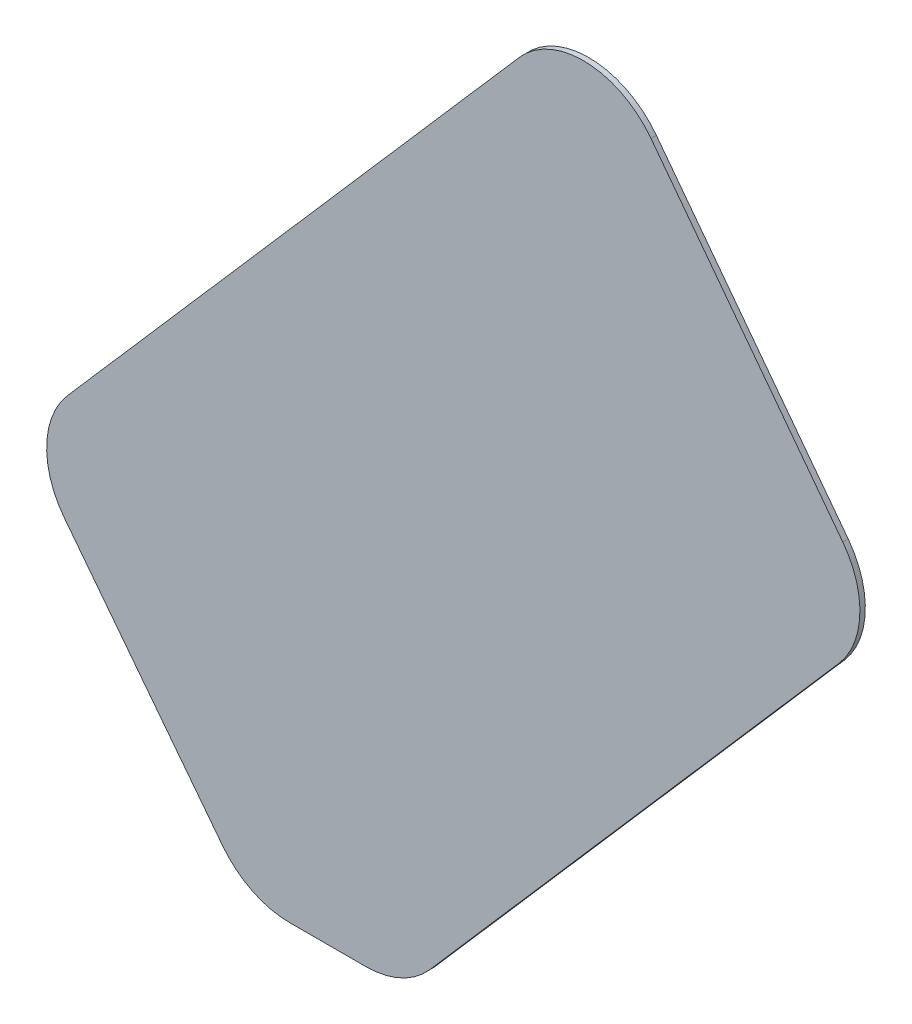
ISO-10303-21;
HEADER;
FILE_DESCRIPTION(('STEP AP214'),'2;1');
FILE_NAME('part.step','',(''),(''),'','','');
FILE_SCHEMA(('AUTOMOTIVE_DESIGN { 1 0 10303 214 1 1 1 1 }'));
ENDSEC;
DATA;
#1=APPLICATION_CONTEXT('core data for automotive mechanical design processes');
#2=APPLICATION_PROTOCOL_DEFINITION('international standard','automotive_design',2000,#1);
#3=PRODUCT_CONTEXT('',#1,'mechanical');
#4=PRODUCT('Part','Part','',(#3));
#5=PRODUCT_RELATED_PRODUCT_CATEGORY('part','',(#4));
#6=PRODUCT_DEFINITION_FORMATION('','',#4);
#7=PRODUCT_DEFINITION_CONTEXT('part definition',#1,'design');
#8=PRODUCT_DEFINITION('design','',#6,#7);
#9=PRODUCT_DEFINITION_SHAPE('','',#8);
#10=(LENGTH_UNIT() NAMED_UNIT(*) SI_UNIT(.MILLI.,.METRE.));
#11=(NAMED_UNIT(*) PLANE_ANGLE_UNIT() SI_UNIT($,.RADIAN.));
#12=(NAMED_UNIT(*) SI_UNIT($,.STERADIAN.) SOLID_ANGLE_UNIT());
#13=UNCERTAINTY_MEASURE_WITH_UNIT(LENGTH_MEASURE(1.E-05),#10,'distance_accuracy_value','');
#14=(GEOMETRIC_REPRESENTATION_CONTEXT(3) GLOBAL_UNCERTAINTY_ASSIGNED_CONTEXT((#13)) GLOBAL_UNIT_ASSIGNED_CONTEXT((#10,
#11,#12)) REPRESENTATION_CONTEXT('',''));
#15=CARTESIAN_POINT('',(0.,0.,0.));
#16=DIRECTION('',(0.,0.,1.));
#17=DIRECTION('',(1.,0.,0.));
#18=AXIS2_PLACEMENT_3D('',#15,#16,#17);
#19=CARTESIAN_POINT('',(-140.634699341157,122.928818651977,1.27));
#20=DIRECTION('',(0.,0.,-1.));
#21=DIRECTION('',(-1.,0.,0.));
#22=AXIS2_PLACEMENT_3D('',#19,#20,#21);
#23=CYLINDRICAL_SURFACE('',#22,40.);
#24=CARTESIAN_POINT('',(-140.634699341157,122.928818651977,-1.27));
#25=DIRECTION('',(0.,0.,-1.));
#26=DIRECTION('',(-1.,0.,0.));
#27=AXIS2_PLACEMENT_3D('',#24,#25,#26);
#28=CIRCLE('',#27,40.);
#29=CARTESIAN_POINT('',(-172.282376692821,98.4661017496174,-1.27));
#30=VERTEX_POINT('',#29);
#31=CARTESIAN_POINT('',(-170.799768972974,149.197974978506,-1.27));
#32=VERTEX_POINT('',#31);
#33=EDGE_CURVE('E147',#30,#32,#28,.T.);
#34=ORIENTED_EDGE('',*,*,#33,.F.);
#35=DIRECTION('',(0.,0.,-1.));
#36=VECTOR('',#35,1.);
#37=CARTESIAN_POINT('',(-172.282376692821,98.4661017496174,1.27));
#38=LINE('',#37,#36);
#39=CARTESIAN_POINT('',(-172.282376692821,98.4661017496174,1.27));
#40=VERTEX_POINT('',#39);
#41=EDGE_CURVE('E11',#40,#30,#38,.T.);
#42=ORIENTED_EDGE('',*,*,#41,.F.);
#43=CARTESIAN_POINT('',(-140.634699341157,122.928818651977,1.27));
#44=DIRECTION('',(0.,0.,-1.));
#45=DIRECTION('',(-1.,0.,0.));
#46=AXIS2_PLACEMENT_3D('',#43,#44,#45);
#47=CIRCLE('',#46,40.);
#48=CARTESIAN_POINT('',(-170.799768972974,149.197974978506,1.27));
#49=VERTEX_POINT('',#48);
#50=EDGE_CURVE('E168',#40,#49,#47,.T.);
#51=ORIENTED_EDGE('',*,*,#50,.T.);
#52=DIRECTION('',(0.,0.,-1.));
#53=VECTOR('',#52,1.);
#54=CARTESIAN_POINT('',(-170.799768972974,149.197974978506,1.27));
#55=LINE('',#54,#53);
#56=EDGE_CURVE('E40',#49,#32,#55,.T.);
#57=ORIENTED_EDGE('',*,*,#56,.T.);
#58=EDGE_LOOP('',(#34,#42,#51,#57));
#59=FACE_BOUND('',#58,.T.);
#60=ADVANCED_FACE('F37',(#59),#23,.T.);
#61=CARTESIAN_POINT('',(-172.282376692821,98.4661017496174,1.27));
#62=DIRECTION('',(0.791191933791605,0.611567922558975,0.));
#63=DIRECTION('',(-0.611567922558975,0.791191933791605,0.));
#64=AXIS2_PLACEMENT_3D('',#61,#62,#63);
#65=PLANE('',#64);
#66=DIRECTION('',(0.611567922558975,-0.791191933791605,0.));
#67=VECTOR('',#66,1.);
#68=CARTESIAN_POINT('',(-172.282376692821,98.4661017496174,-1.27));
#69=LINE('',#68,#67);
#70=CARTESIAN_POINT('',(-97.5673216487999,1.80643942417054,-1.27));
#71=VERTEX_POINT('',#70);
#72=EDGE_CURVE('E88',#30,#71,#69,.T.);
#73=ORIENTED_EDGE('',*,*,#72,.T.);
#74=DIRECTION('',(0.,0.,-1.));
#75=VECTOR('',#74,1.);
#76=CARTESIAN_POINT('',(-97.5673216487999,1.80643942417054,1.27));
#77=LINE('',#76,#75);
#78=CARTESIAN_POINT('',(-97.5673216487999,1.80643942417054,1.27));
#79=VERTEX_POINT('',#78);
#80=EDGE_CURVE('E46',#79,#71,#77,.T.);
#81=ORIENTED_EDGE('',*,*,#80,.F.);
#82=DIRECTION('',(0.611567922558975,-0.791191933791605,0.));
#83=VECTOR('',#82,1.);
#84=CARTESIAN_POINT('',(-172.282376692821,98.4661017496174,1.27));
#85=LINE('',#84,#83);
#86=EDGE_CURVE('E125',#40,#79,#85,.T.);
#87=ORIENTED_EDGE('',*,*,#86,.F.);
#88=ORIENTED_EDGE('',*,*,#41,.T.);
#89=EDGE_LOOP('',(#73,#81,#87,#88));
#90=FACE_BOUND('',#89,.T.);
#91=ADVANCED_FACE('F228',(#90),#65,.F.);
#92=CARTESIAN_POINT('',(-65.9196442971355,26.2691563265294,1.27));
#93=DIRECTION('',(0.,0.,-1.));
#94=DIRECTION('',(-1.,0.,0.));
#95=AXIS2_PLACEMENT_3D('',#92,#93,#94);
#96=CYLINDRICAL_SURFACE('',#95,40.);
#97=CARTESIAN_POINT('',(-65.9196442971355,26.2691563265294,-1.27));
#98=DIRECTION('',(0.,0.,1.));
#99=DIRECTION('',(1.,0.,0.));
#100=AXIS2_PLACEMENT_3D('',#97,#98,#99);
#101=CIRCLE('',#100,40.);
#102=CARTESIAN_POINT('',(-65.9196442971355,-13.7308436734706,-1.27));
#103=VERTEX_POINT('',#102);
#104=EDGE_CURVE('E132',#71,#103,#101,.T.);
#105=ORIENTED_EDGE('',*,*,#104,.T.);
#106=DIRECTION('',(0.,0.,-1.));
#107=VECTOR('',#106,1.);
#108=CARTESIAN_POINT('',(-65.9196442971355,-13.7308436734706,1.27));
#109=LINE('',#108,#107);
#110=CARTESIAN_POINT('',(-65.9196442971355,-13.7308436734706,1.27));
#111=VERTEX_POINT('',#110);
#112=EDGE_CURVE('E129',#111,#103,#109,.T.);
#113=ORIENTED_EDGE('',*,*,#112,.F.);
#114=CARTESIAN_POINT('',(-65.9196442971355,26.2691563265294,1.27));
#115=DIRECTION('',(0.,0.,1.));
#116=DIRECTION('',(1.,0.,0.));
#117=AXIS2_PLACEMENT_3D('',#114,#115,#116);
#118=CIRCLE('',#117,40.);
#119=EDGE_CURVE('E118',#79,#111,#118,.T.);
#120=ORIENTED_EDGE('',*,*,#119,.F.);
#121=ORIENTED_EDGE('',*,*,#80,.T.);
#122=EDGE_LOOP('',(#105,#113,#120,#121));
#123=FACE_BOUND('',#122,.T.);
#124=ADVANCED_FACE('F130',(#123),#96,.T.);
#125=CARTESIAN_POINT('',(-65.9196442971355,-13.7308436734706,1.27));
#126=DIRECTION('',(0.,1.,0.));
#127=DIRECTION('',(0.,0.,1.));
#128=AXIS2_PLACEMENT_3D('',#125,#126,#127);
#129=PLANE('',#128);
#130=DIRECTION('',(1.,0.,0.));
#131=VECTOR('',#130,1.);
#132=CARTESIAN_POINT('',(-65.9196442971355,-13.7308436734706,-1.27));
#133=LINE('',#132,#131);
#134=CARTESIAN_POINT('',(-30.165069631817,-13.7308436734706,-1.27));
#135=VERTEX_POINT('',#134);
#136=EDGE_CURVE('E165',#103,#135,#133,.T.);
#137=ORIENTED_EDGE('',*,*,#136,.T.);
#138=DIRECTION('',(0.,0.,-1.));
#139=VECTOR('',#138,1.);
#140=CARTESIAN_POINT('',(-30.165069631817,-13.7308436734706,1.27));
#141=LINE('',#140,#139);
#142=CARTESIAN_POINT('',(-30.165069631817,-13.7308436734706,1.27));
#143=VERTEX_POINT('',#142);
#144=EDGE_CURVE('E135',#143,#135,#141,.T.);
#145=ORIENTED_EDGE('',*,*,#144,.F.);
#146=DIRECTION('',(1.,0.,0.));
#147=VECTOR('',#146,1.);
#148=CARTESIAN_POINT('',(-65.9196442971355,-13.7308436734706,1.27));
#149=LINE('',#148,#147);
#150=EDGE_CURVE('E123',#111,#143,#149,.T.);
#151=ORIENTED_EDGE('',*,*,#150,.F.);
#152=ORIENTED_EDGE('',*,*,#112,.T.);
#153=EDGE_LOOP('',(#137,#145,#151,#152));
#154=FACE_BOUND('',#153,.T.);
#155=ADVANCED_FACE('F137',(#154),#129,.F.);
#156=CARTESIAN_POINT('',(-30.165069631817,26.2691563265294,1.27));
#157=DIRECTION('',(0.,0.,-1.));
#158=DIRECTION('',(-1.,0.,0.));
#159=AXIS2_PLACEMENT_3D('',#156,#157,#158);
#160=CYLINDRICAL_SURFACE('',#159,40.);
#161=CARTESIAN_POINT('',(-30.165069631817,26.2691563265294,-1.27));
#162=DIRECTION('',(0.,0.,1.));
#163=DIRECTION('',(1.,0.,0.));
#164=AXIS2_PLACEMENT_3D('',#161,#162,#163);
#165=CIRCLE('',#164,40.);
#166=CARTESIAN_POINT('',(0.,0.,-1.27));
#167=VERTEX_POINT('',#166);
#168=EDGE_CURVE('E163',#135,#167,#165,.T.);
#169=ORIENTED_EDGE('',*,*,#168,.T.);
#170=DIRECTION('',(0.,0.,-1.));
#171=VECTOR('',#170,1.);
#172=CARTESIAN_POINT('',(0.,0.,1.27));
#173=LINE('',#172,#171);
#174=CARTESIAN_POINT('',(0.,0.,1.27));
#175=VERTEX_POINT('',#174);
#176=EDGE_CURVE('E172',#175,#167,#173,.T.);
#177=ORIENTED_EDGE('',*,*,#176,.F.);
#178=CARTESIAN_POINT('',(-30.165069631817,26.2691563265294,1.27));
#179=DIRECTION('',(0.,0.,1.));
#180=DIRECTION('',(1.,0.,0.));
#181=AXIS2_PLACEMENT_3D('',#178,#179,#180);
#182=CIRCLE('',#181,40.);
#183=EDGE_CURVE('E140',#143,#175,#182,.T.);
#184=ORIENTED_EDGE('',*,*,#183,.F.);
#185=ORIENTED_EDGE('',*,*,#144,.T.);
#186=EDGE_LOOP('',(#169,#177,#184,#185));
#187=FACE_BOUND('',#186,.T.);
#188=ADVANCED_FACE('F190',(#187),#160,.T.);
#189=CARTESIAN_POINT('',(0.,0.,1.27));
#190=DIRECTION('',(-0.754126740795419,0.656728908163238,0.));
#191=DIRECTION('',(-0.656728908163238,-0.754126740795419,0.));
#192=AXIS2_PLACEMENT_3D('',#189,#190,#191);
#193=PLANE('',#192);
#194=DIRECTION('',(0.656728908163238,0.754126740795419,0.));
#195=VECTOR('',#194,1.);
#196=CARTESIAN_POINT('',(0.,0.,-1.27));
#197=LINE('',#196,#195);
#198=CARTESIAN_POINT('',(193.218844760221,221.874651546576,-1.27));
#199=VERTEX_POINT('',#198);
#200=EDGE_CURVE('E161',#167,#199,#197,.T.);
#201=ORIENTED_EDGE('',*,*,#200,.T.);
#202=DIRECTION('',(0.,0.,-1.));
#203=VECTOR('',#202,1.);
#204=CARTESIAN_POINT('',(193.218844760221,221.874651546576,1.27));
#205=LINE('',#204,#203);
#206=CARTESIAN_POINT('',(193.218844760221,221.874651546576,1.27));
#207=VERTEX_POINT('',#206);
#208=EDGE_CURVE('E175',#207,#199,#205,.T.);
#209=ORIENTED_EDGE('',*,*,#208,.F.);
#210=DIRECTION('',(0.656728908163238,0.754126740795419,0.));
#211=VECTOR('',#210,1.);
#212=CARTESIAN_POINT('',(0.,0.,1.27));
#213=LINE('',#212,#211);
#214=EDGE_CURVE('E142',#175,#207,#213,.T.);
#215=ORIENTED_EDGE('',*,*,#214,.F.);
#216=ORIENTED_EDGE('',*,*,#176,.T.);
#217=EDGE_LOOP('',(#201,#209,#215,#216));
#218=FACE_BOUND('',#217,.T.);
#219=ADVANCED_FACE('F198',(#218),#193,.F.);
#220=CARTESIAN_POINT('',(163.053775128404,248.143807873105,1.27));
#221=DIRECTION('',(0.,0.,-1.));
#222=DIRECTION('',(-1.,0.,0.));
#223=AXIS2_PLACEMENT_3D('',#220,#221,#222);
#224=CYLINDRICAL_SURFACE('',#223,40.0000000000001);
#225=CARTESIAN_POINT('',(163.053775128404,248.143807873105,-1.27));
#226=DIRECTION('',(0.,0.,1.));
#227=DIRECTION('',(1.,0.,0.));
#228=AXIS2_PLACEMENT_3D('',#225,#226,#227);
#229=CIRCLE('',#228,40.0000000000001);
#230=CARTESIAN_POINT('',(194.956497425815,272.272966789535,-1.27));
#231=VERTEX_POINT('',#230);
#232=EDGE_CURVE('E159',#199,#231,#229,.T.);
#233=ORIENTED_EDGE('',*,*,#232,.T.);
#234=DIRECTION('',(0.,0.,-1.));
#235=VECTOR('',#234,1.);
#236=CARTESIAN_POINT('',(194.956497425815,272.272966789535,1.27));
#237=LINE('',#236,#235);
#238=CARTESIAN_POINT('',(194.956497425815,272.272966789535,1.27));
#239=VERTEX_POINT('',#238);
#240=EDGE_CURVE('E178',#239,#231,#237,.T.);
#241=ORIENTED_EDGE('',*,*,#240,.F.);
#242=CARTESIAN_POINT('',(163.053775128404,248.143807873105,1.27));
#243=DIRECTION('',(0.,0.,1.));
#244=DIRECTION('',(1.,0.,0.));
#245=AXIS2_PLACEMENT_3D('',#242,#243,#244);
#246=CIRCLE('',#245,40.0000000000001);
#247=EDGE_CURVE('E195',#207,#239,#246,.T.);
#248=ORIENTED_EDGE('',*,*,#247,.F.);
#249=ORIENTED_EDGE('',*,*,#208,.T.);
#250=EDGE_LOOP('',(#233,#241,#248,#249));
#251=FACE_BOUND('',#250,.T.);
#252=ADVANCED_FACE('F201',(#251),#224,.T.);
#253=CARTESIAN_POINT('',(194.956497425815,272.272966789535,1.27));
#254=DIRECTION('',(-0.797568057435264,-0.603228972910734,0.));
#255=DIRECTION('',(0.603228972910734,-0.797568057435264,0.));
#256=AXIS2_PLACEMENT_3D('',#253,#254,#255);
#257=PLANE('',#256);
#258=DIRECTION('',(-0.603228972910734,0.797568057435264,0.));
#259=VECTOR('',#258,1.);
#260=CARTESIAN_POINT('',(194.956497425815,272.272966789535,-1.27));
#261=LINE('',#260,#259);
#262=CARTESIAN_POINT('',(104.48279509688,391.894102802415,-1.27));
#263=VERTEX_POINT('',#262);
#264=EDGE_CURVE('E156',#231,#263,#261,.T.);
#265=ORIENTED_EDGE('',*,*,#264,.T.);
#266=DIRECTION('',(0.,0.,-1.));
#267=VECTOR('',#266,1.);
#268=CARTESIAN_POINT('',(104.48279509688,391.894102802415,1.27));
#269=LINE('',#268,#267);
#270=CARTESIAN_POINT('',(104.48279509688,391.894102802415,1.27));
#271=VERTEX_POINT('',#270);
#272=EDGE_CURVE('E181',#271,#263,#269,.T.);
#273=ORIENTED_EDGE('',*,*,#272,.F.);
#274=DIRECTION('',(-0.603228972910734,0.797568057435264,0.));
#275=VECTOR('',#274,1.);
#276=CARTESIAN_POINT('',(194.956497425815,272.272966789535,1.27));
#277=LINE('',#276,#275);
#278=EDGE_CURVE('E203',#239,#271,#277,.T.);
#279=ORIENTED_EDGE('',*,*,#278,.F.);
#280=ORIENTED_EDGE('',*,*,#240,.T.);
#281=EDGE_LOOP('',(#265,#273,#279,#280));
#282=FACE_BOUND('',#281,.T.);
#283=ADVANCED_FACE('F218',(#282),#257,.F.);
#284=CARTESIAN_POINT('',(72.5800727994694,367.764943885986,1.27));
#285=DIRECTION('',(0.,0.,-1.));
#286=DIRECTION('',(-1.,0.,0.));
#287=AXIS2_PLACEMENT_3D('',#284,#285,#286);
#288=CYLINDRICAL_SURFACE('',#287,40.);
#289=CARTESIAN_POINT('',(72.5800727994694,367.764943885986,-1.27));
#290=DIRECTION('',(0.,0.,-1.));
#291=DIRECTION('',(-1.,0.,0.));
#292=AXIS2_PLACEMENT_3D('',#289,#290,#291);
#293=CIRCLE('',#292,40.);
#294=CARTESIAN_POINT('',(42.4150031676527,394.034100212515,-1.27));
#295=VERTEX_POINT('',#294);
#296=EDGE_CURVE('E153',#295,#263,#293,.T.);
#297=ORIENTED_EDGE('',*,*,#296,.F.);
#298=DIRECTION('',(0.,0.,-1.));
#299=VECTOR('',#298,1.);
#300=CARTESIAN_POINT('',(42.4150031676527,394.034100212515,1.27));
#301=LINE('',#300,#299);
#302=CARTESIAN_POINT('',(42.4150031676527,394.034100212515,1.27));
#303=VERTEX_POINT('',#302);
#304=EDGE_CURVE('E182',#303,#295,#301,.T.);
#305=ORIENTED_EDGE('',*,*,#304,.F.);
#306=CARTESIAN_POINT('',(72.5800727994694,367.764943885986,1.27));
#307=DIRECTION('',(0.,0.,-1.));
#308=DIRECTION('',(-1.,0.,0.));
#309=AXIS2_PLACEMENT_3D('',#306,#307,#308);
#310=CIRCLE('',#309,40.);
#311=EDGE_CURVE('E205',#303,#271,#310,.T.);
#312=ORIENTED_EDGE('',*,*,#311,.T.);
#313=ORIENTED_EDGE('',*,*,#272,.T.);
#314=EDGE_LOOP('',(#297,#305,#312,#313));
#315=FACE_BOUND('',#314,.T.);
#316=ADVANCED_FACE('F215',(#315),#288,.T.);
#317=CARTESIAN_POINT('',(-170.799768972974,149.197974978506,1.27));
#318=DIRECTION('',(-0.754126740795419,0.656728908163238,0.));
#319=DIRECTION('',(-0.656728908163238,-0.754126740795419,0.));
#320=AXIS2_PLACEMENT_3D('',#317,#318,#319);
#321=PLANE('',#320);
#322=DIRECTION('',(0.656728908163238,0.754126740795419,0.));
#323=VECTOR('',#322,1.);
#324=CARTESIAN_POINT('',(-170.799768972974,149.197974978506,-1.27));
#325=LINE('',#324,#323);
#326=EDGE_CURVE('E150',#32,#295,#325,.T.);
#327=ORIENTED_EDGE('',*,*,#326,.F.);
#328=ORIENTED_EDGE('',*,*,#56,.F.);
#329=DIRECTION('',(0.656728908163238,0.754126740795419,0.));
#330=VECTOR('',#329,1.);
#331=CARTESIAN_POINT('',(-170.799768972974,149.197974978506,1.27));
#332=LINE('',#331,#330);
#333=EDGE_CURVE('E210',#49,#303,#332,.T.);
#334=ORIENTED_EDGE('',*,*,#333,.T.);
#335=ORIENTED_EDGE('',*,*,#304,.T.);
#336=EDGE_LOOP('',(#327,#328,#334,#335));
#337=FACE_BOUND('',#336,.T.);
#338=ADVANCED_FACE('F184',(#337),#321,.T.);
#339=CARTESIAN_POINT('',(-140.634699341157,122.928818651977,1.27));
#340=DIRECTION('',(0.,0.,-1.));
#341=DIRECTION('',(-1.,0.,0.));
#342=AXIS2_PLACEMENT_3D('',#339,#340,#341);
#343=PLANE('',#342);
#344=ORIENTED_EDGE('',*,*,#50,.F.);
#345=ORIENTED_EDGE('',*,*,#86,.T.);
#346=ORIENTED_EDGE('',*,*,#119,.T.);
#347=ORIENTED_EDGE('',*,*,#150,.T.);
#348=ORIENTED_EDGE('',*,*,#183,.T.);
#349=ORIENTED_EDGE('',*,*,#214,.T.);
#350=ORIENTED_EDGE('',*,*,#247,.T.);
#351=ORIENTED_EDGE('',*,*,#278,.T.);
#352=ORIENTED_EDGE('',*,*,#311,.F.);
#353=ORIENTED_EDGE('',*,*,#333,.F.);
#354=EDGE_LOOP('',(#344,#345,#346,#347,#348,#349,#350,#351,#352,#353));
#355=FACE_BOUND('',#354,.T.);
#356=ADVANCED_FACE('F121',(#355),#343,.F.);
#357=CARTESIAN_POINT('',(-140.634699341157,122.928818651977,-1.27));
#358=DIRECTION('',(0.,0.,-1.));
#359=DIRECTION('',(-1.,0.,0.));
#360=AXIS2_PLACEMENT_3D('',#357,#358,#359);
#361=PLANE('',#360);
#362=ORIENTED_EDGE('',*,*,#33,.T.);
#363=ORIENTED_EDGE('',*,*,#326,.T.);
#364=ORIENTED_EDGE('',*,*,#296,.T.);
#365=ORIENTED_EDGE('',*,*,#264,.F.);
#366=ORIENTED_EDGE('',*,*,#232,.F.);
#367=ORIENTED_EDGE('',*,*,#200,.F.);
#368=ORIENTED_EDGE('',*,*,#168,.F.);
#369=ORIENTED_EDGE('',*,*,#136,.F.);
#370=ORIENTED_EDGE('',*,*,#104,.F.);
#371=ORIENTED_EDGE('',*,*,#72,.F.);
#372=EDGE_LOOP('',(#362,#363,#364,#365,#366,#367,#368,#369,#370,#371));
#373=FACE_BOUND('',#372,.T.);
#374=ADVANCED_FACE('F186',(#373),#361,.T.);
#375=CLOSED_SHELL('',(#60,#91,#124,#155,#188,#219,#252,#283,#316,#338,#356,#374));
#376=MANIFOLD_SOLID_BREP('B2',#375);
#377=ADVANCED_BREP_SHAPE_REPRESENTATION('',(#18,#376),#14);
#378=SHAPE_DEFINITION_REPRESENTATION(#9,#377);
ENDSEC;
END-ISO-10303-21;
